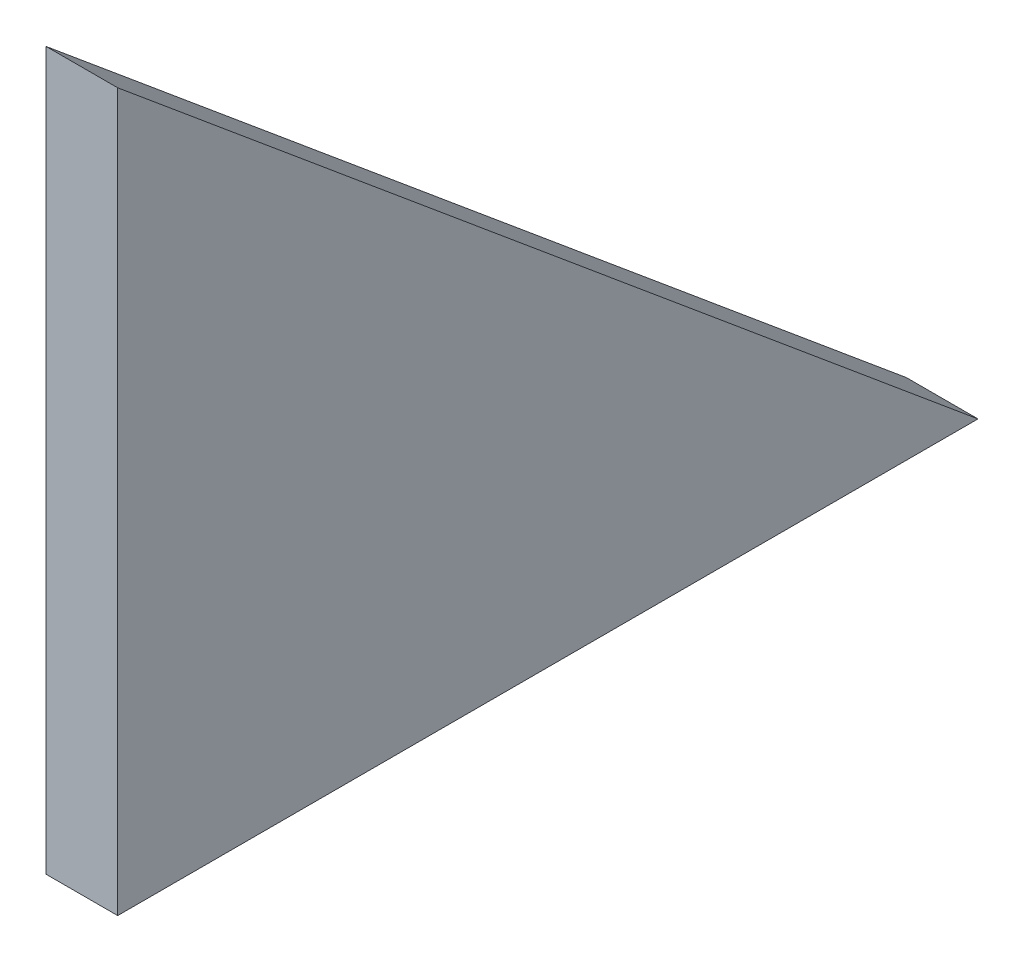
ISO-10303-21;
HEADER;
FILE_DESCRIPTION(('STEP AP214'),'2;1');
FILE_NAME('part.step','',(''),(''),'','','');
FILE_SCHEMA(('AUTOMOTIVE_DESIGN { 1 0 10303 214 1 1 1 1 }'));
ENDSEC;
DATA;
#1=APPLICATION_CONTEXT('core data for automotive mechanical design processes');
#2=APPLICATION_PROTOCOL_DEFINITION('international standard','automotive_design',2000,#1);
#3=PRODUCT_CONTEXT('',#1,'mechanical');
#4=PRODUCT('Part','Part','',(#3));
#5=PRODUCT_RELATED_PRODUCT_CATEGORY('part','',(#4));
#6=PRODUCT_DEFINITION_FORMATION('','',#4);
#7=PRODUCT_DEFINITION_CONTEXT('part definition',#1,'design');
#8=PRODUCT_DEFINITION('design','',#6,#7);
#9=PRODUCT_DEFINITION_SHAPE('','',#8);
#10=(LENGTH_UNIT() NAMED_UNIT(*) SI_UNIT(.MILLI.,.METRE.));
#11=(NAMED_UNIT(*) PLANE_ANGLE_UNIT() SI_UNIT($,.RADIAN.));
#12=(NAMED_UNIT(*) SI_UNIT($,.STERADIAN.) SOLID_ANGLE_UNIT());
#13=UNCERTAINTY_MEASURE_WITH_UNIT(LENGTH_MEASURE(1.E-05),#10,'distance_accuracy_value','');
#14=(GEOMETRIC_REPRESENTATION_CONTEXT(3) GLOBAL_UNCERTAINTY_ASSIGNED_CONTEXT((#13)) GLOBAL_UNIT_ASSIGNED_CONTEXT((#10,
#11,#12)) REPRESENTATION_CONTEXT('',''));
#15=CARTESIAN_POINT('',(0.,0.,0.));
#16=DIRECTION('',(0.,0.,1.));
#17=DIRECTION('',(1.,0.,0.));
#18=AXIS2_PLACEMENT_3D('',#15,#16,#17);
#19=CARTESIAN_POINT('',(5.,50.,0.));
#20=DIRECTION('',(0.,0.,-1.));
#21=DIRECTION('',(0.,1.,0.));
#22=AXIS2_PLACEMENT_3D('',#19,#20,#21);
#23=PLANE('',#22);
#24=DIRECTION('',(0.,-1.,0.));
#25=VECTOR('',#24,1.);
#26=CARTESIAN_POINT('',(0.,50.,0.));
#27=LINE('',#26,#25);
#28=CARTESIAN_POINT('',(0.,50.,0.));
#29=VERTEX_POINT('',#28);
#30=CARTESIAN_POINT('',(0.,0.,0.));
#31=VERTEX_POINT('',#30);
#32=EDGE_CURVE('E82',#29,#31,#27,.T.);
#33=ORIENTED_EDGE('',*,*,#32,.T.);
#34=DIRECTION('',(-1.,0.,0.));
#35=VECTOR('',#34,1.);
#36=CARTESIAN_POINT('',(5.,0.,0.));
#37=LINE('',#36,#35);
#38=CARTESIAN_POINT('',(5.,0.,0.));
#39=VERTEX_POINT('',#38);
#40=EDGE_CURVE('E11',#39,#31,#37,.T.);
#41=ORIENTED_EDGE('',*,*,#40,.F.);
#42=DIRECTION('',(0.,-1.,0.));
#43=VECTOR('',#42,1.);
#44=CARTESIAN_POINT('',(5.,50.,0.));
#45=LINE('',#44,#43);
#46=CARTESIAN_POINT('',(5.,50.,0.));
#47=VERTEX_POINT('',#46);
#48=EDGE_CURVE('E75',#47,#39,#45,.T.);
#49=ORIENTED_EDGE('',*,*,#48,.F.);
#50=DIRECTION('',(-1.,0.,0.));
#51=VECTOR('',#50,1.);
#52=CARTESIAN_POINT('',(5.,50.,0.));
#53=LINE('',#52,#51);
#54=EDGE_CURVE('E83',#47,#29,#53,.T.);
#55=ORIENTED_EDGE('',*,*,#54,.T.);
#56=EDGE_LOOP('',(#33,#41,#49,#55));
#57=FACE_BOUND('',#56,.T.);
#58=ADVANCED_FACE('F35',(#57),#23,.F.);
#59=CARTESIAN_POINT('',(5.,0.,0.));
#60=DIRECTION('',(0.,1.,0.));
#61=DIRECTION('',(0.,0.,1.));
#62=AXIS2_PLACEMENT_3D('',#59,#60,#61);
#63=PLANE('',#62);
#64=DIRECTION('',(0.,0.,-1.));
#65=VECTOR('',#64,1.);
#66=CARTESIAN_POINT('',(0.,0.,0.));
#67=LINE('',#66,#65);
#68=CARTESIAN_POINT('',(0.,0.,-60.));
#69=VERTEX_POINT('',#68);
#70=EDGE_CURVE('E63',#31,#69,#67,.T.);
#71=ORIENTED_EDGE('',*,*,#70,.T.);
#72=DIRECTION('',(-1.,0.,0.));
#73=VECTOR('',#72,1.);
#74=CARTESIAN_POINT('',(5.,0.,-60.));
#75=LINE('',#74,#73);
#76=CARTESIAN_POINT('',(5.,0.,-60.));
#77=VERTEX_POINT('',#76);
#78=EDGE_CURVE('E43',#77,#69,#75,.T.);
#79=ORIENTED_EDGE('',*,*,#78,.F.);
#80=DIRECTION('',(0.,0.,-1.));
#81=VECTOR('',#80,1.);
#82=CARTESIAN_POINT('',(5.,0.,0.));
#83=LINE('',#82,#81);
#84=EDGE_CURVE('E71',#39,#77,#83,.T.);
#85=ORIENTED_EDGE('',*,*,#84,.F.);
#86=ORIENTED_EDGE('',*,*,#40,.T.);
#87=EDGE_LOOP('',(#71,#79,#85,#86));
#88=FACE_BOUND('',#87,.T.);
#89=ADVANCED_FACE('F72',(#88),#63,.F.);
#90=CARTESIAN_POINT('',(5.,0.,-60.));
#91=DIRECTION('',(0.,-0.768221279597376,0.64018439966448));
#92=DIRECTION('',(0.,-0.64018439966448,-0.768221279597376));
#93=AXIS2_PLACEMENT_3D('',#90,#91,#92);
#94=PLANE('',#93);
#95=DIRECTION('',(0.,0.64018439966448,0.768221279597376));
#96=VECTOR('',#95,1.);
#97=CARTESIAN_POINT('',(0.,0.,-60.));
#98=LINE('',#97,#96);
#99=EDGE_CURVE('E68',#69,#29,#98,.T.);
#100=ORIENTED_EDGE('',*,*,#99,.T.);
#101=ORIENTED_EDGE('',*,*,#54,.F.);
#102=DIRECTION('',(0.,0.64018439966448,0.768221279597376));
#103=VECTOR('',#102,1.);
#104=CARTESIAN_POINT('',(5.,0.,-60.));
#105=LINE('',#104,#103);
#106=EDGE_CURVE('E51',#77,#47,#105,.T.);
#107=ORIENTED_EDGE('',*,*,#106,.F.);
#108=ORIENTED_EDGE('',*,*,#78,.T.);
#109=EDGE_LOOP('',(#100,#101,#107,#108));
#110=FACE_BOUND('',#109,.T.);
#111=ADVANCED_FACE('F90',(#110),#94,.F.);
#112=CARTESIAN_POINT('',(5.,0.,0.));
#113=DIRECTION('',(1.,0.,0.));
#114=DIRECTION('',(0.,0.,-1.));
#115=AXIS2_PLACEMENT_3D('',#112,#113,#114);
#116=PLANE('',#115);
#117=ORIENTED_EDGE('',*,*,#48,.T.);
#118=ORIENTED_EDGE('',*,*,#84,.T.);
#119=ORIENTED_EDGE('',*,*,#106,.T.);
#120=EDGE_LOOP('',(#117,#118,#119));
#121=FACE_BOUND('',#120,.T.);
#122=ADVANCED_FACE('F78',(#121),#116,.T.);
#123=CARTESIAN_POINT('',(0.,0.,0.));
#124=DIRECTION('',(1.,0.,0.));
#125=DIRECTION('',(0.,0.,-1.));
#126=AXIS2_PLACEMENT_3D('',#123,#124,#125);
#127=PLANE('',#126);
#128=ORIENTED_EDGE('',*,*,#32,.F.);
#129=ORIENTED_EDGE('',*,*,#99,.F.);
#130=ORIENTED_EDGE('',*,*,#70,.F.);
#131=EDGE_LOOP('',(#128,#129,#130));
#132=FACE_BOUND('',#131,.T.);
#133=ADVANCED_FACE('F91',(#132),#127,.F.);
#134=CLOSED_SHELL('',(#58,#89,#111,#122,#133));
#135=MANIFOLD_SOLID_BREP('B2',#134);
#136=ADVANCED_BREP_SHAPE_REPRESENTATION('',(#18,#135),#14);
#137=SHAPE_DEFINITION_REPRESENTATION(#9,#136);
ENDSEC;
END-ISO-10303-21;
